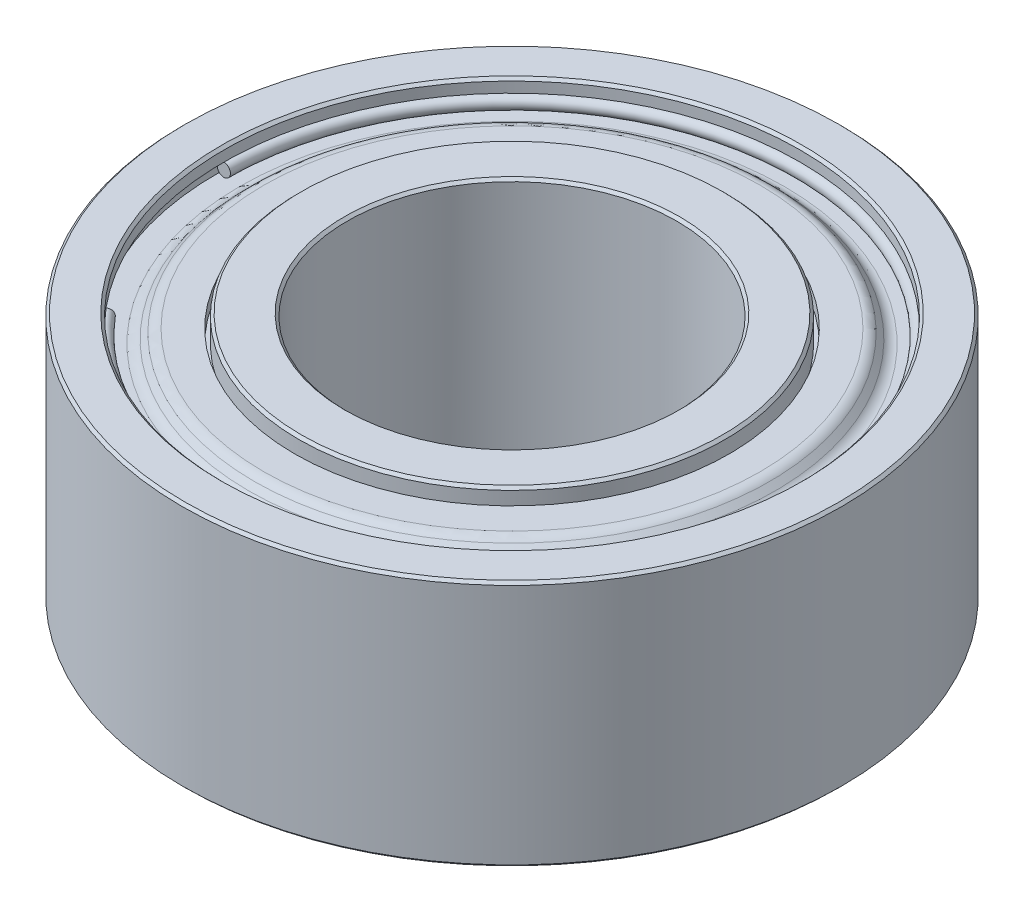
ISO-10303-21;
HEADER;
FILE_DESCRIPTION(('STEP AP214'),'2;1');
FILE_NAME('part.step','',(''),(''),'','','');
FILE_SCHEMA(('AUTOMOTIVE_DESIGN { 1 0 10303 214 1 1 1 1 }'));
ENDSEC;
DATA;
#1=APPLICATION_CONTEXT('core data for automotive mechanical design processes');
#2=APPLICATION_PROTOCOL_DEFINITION('international standard','automotive_design',2000,#1);
#3=PRODUCT_CONTEXT('',#1,'mechanical');
#4=PRODUCT('Part','Part','',(#3));
#5=PRODUCT_RELATED_PRODUCT_CATEGORY('part','',(#4));
#6=PRODUCT_DEFINITION_FORMATION('','',#4);
#7=PRODUCT_DEFINITION_CONTEXT('part definition',#1,'design');
#8=PRODUCT_DEFINITION('design','',#6,#7);
#9=PRODUCT_DEFINITION_SHAPE('','',#8);
#10=(LENGTH_UNIT() NAMED_UNIT(*) SI_UNIT(.MILLI.,.METRE.));
#11=(NAMED_UNIT(*) PLANE_ANGLE_UNIT() SI_UNIT($,.RADIAN.));
#12=(NAMED_UNIT(*) SI_UNIT($,.STERADIAN.) SOLID_ANGLE_UNIT());
#13=UNCERTAINTY_MEASURE_WITH_UNIT(LENGTH_MEASURE(1.E-05),#10,'distance_accuracy_value','');
#14=(GEOMETRIC_REPRESENTATION_CONTEXT(3) GLOBAL_UNCERTAINTY_ASSIGNED_CONTEXT((#13)) GLOBAL_UNIT_ASSIGNED_CONTEXT((#10,
#11,#12)) REPRESENTATION_CONTEXT('',''));
#15=CARTESIAN_POINT('',(0.,0.,0.));
#16=DIRECTION('',(0.,0.,1.));
#17=DIRECTION('',(1.,0.,0.));
#18=AXIS2_PLACEMENT_3D('',#15,#16,#17);
#19=CARTESIAN_POINT('',(0.,0.,0.));
#20=DIRECTION('',(0.64278760968653,0.,0.766044443118986));
#21=DIRECTION('',(0.766044443118986,0.,-0.64278760968653));
#22=AXIS2_PLACEMENT_3D('',#19,#20,#21);
#23=PLANE('',#22);
#24=CARTESIAN_POINT('',(-4.15418241058994,2.00025,3.48577292856909));
#25=CARTESIAN_POINT('',(-4.15418930493398,2.01448035707391,3.48577871361062));
#26=CARTESIAN_POINT('',(-4.15604733989819,2.02879828029162,3.48733779006381));
#27=CARTESIAN_POINT('',(-4.16328592517261,2.05577713981076,3.49341168429782));
#28=CARTESIAN_POINT('',(-4.16866647548281,2.06843807611218,3.49792650207864));
#29=CARTESIAN_POINT('',(-4.18233551241622,2.0907338982527,3.50939618592801));
#30=CARTESIAN_POINT('',(-4.1906239990395,2.10036878409172,3.51635105199662));
#31=CARTESIAN_POINT('',(-4.20917658235864,2.11551068307499,3.5319185178171));
#32=CARTESIAN_POINT('',(-4.2194406790545,2.12101769621925,3.54053111756897));
#33=CARTESIAN_POINT('',(-4.24078669527091,2.12728686264336,3.55844255190326));
#34=CARTESIAN_POINT('',(-4.25186861479146,2.12804901592321,3.56774138648568));
#35=CARTESIAN_POINT('',(-4.2736010893698,2.12474255040931,3.58597709788894));
#36=CARTESIAN_POINT('',(-4.2842516444276,2.12067393161555,3.59491397470978));
#37=CARTESIAN_POINT('',(-4.3039203487017,2.10816068190603,3.6114179772119));
#38=CARTESIAN_POINT('',(-4.31293849791799,2.09971605099026,3.61898510289319));
#39=CARTESIAN_POINT('',(-4.32832653587489,2.07941861413728,3.63189719986737));
#40=CARTESIAN_POINT('',(-4.33469642461549,2.06756580820007,3.63724217116025));
#41=CARTESIAN_POINT('',(-4.34406656395272,2.0417292051199,3.64510465162219));
#42=CARTESIAN_POINT('',(-4.34706681454934,2.02774540797693,3.64762216079126));
#43=CARTESIAN_POINT('',(-4.34858022980807,2.00916030553464,3.64889206697668));
#44=CARTESIAN_POINT('',(-4.34875985966417,2.00470945246293,3.64904279432268));
#45=CARTESIAN_POINT('',(-4.34875080479814,1.98601964292609,3.64903519638793));
#46=CARTESIAN_POINT('',(-4.34689276983392,1.97170171970838,3.64747611993475));
#47=CARTESIAN_POINT('',(-4.3396541845595,1.94472286018924,3.64140222570074));
#48=CARTESIAN_POINT('',(-4.3342736342493,1.93206192388782,3.63688740791991));
#49=CARTESIAN_POINT('',(-4.32060459731589,1.9097661017473,3.62541772407054));
#50=CARTESIAN_POINT('',(-4.31231611069261,1.90013121590828,3.61846285800193));
#51=CARTESIAN_POINT('',(-4.29376352737347,1.884989316925,3.60289539218146));
#52=CARTESIAN_POINT('',(-4.28349943067761,1.87948230378075,3.59428279242959));
#53=CARTESIAN_POINT('',(-4.2621534144612,1.87321313735664,3.5763713580953));
#54=CARTESIAN_POINT('',(-4.25107149494066,1.87245098407679,3.56707252351287));
#55=CARTESIAN_POINT('',(-4.22933902036231,1.87575744959069,3.54883681210961));
#56=CARTESIAN_POINT('',(-4.21868846530451,1.87982606838444,3.53989993528878));
#57=CARTESIAN_POINT('',(-4.19901976103042,1.89233931809397,3.52339593278665));
#58=CARTESIAN_POINT('',(-4.19000161181412,1.90078394900974,3.51582880710536));
#59=CARTESIAN_POINT('',(-4.17461357385723,1.92108138586272,3.50291671013119));
#60=CARTESIAN_POINT('',(-4.16824368511663,1.93293419179993,3.49757173883831));
#61=CARTESIAN_POINT('',(-4.1588735457794,1.9587707948801,3.48970925837636));
#62=CARTESIAN_POINT('',(-4.15587329518277,1.97275459202306,3.48719174920729));
#63=CARTESIAN_POINT('',(-4.15435987992404,1.99133969446536,3.48592184302187));
#64=CARTESIAN_POINT('',(-4.15418025006795,1.99579054753707,3.48577111567587));
#65=CARTESIAN_POINT('',(-4.15418241058994,2.00025,3.48577292856909));
#66=B_SPLINE_CURVE_WITH_KNOTS('',3,(#24,#25,#26,#27,#28,#29,#30,#31,#32,#33,#34,#35,#36,#37,#38,
#39,#40,#41,#42,#43,#44,#45,#46,#47,#48,#49,#50,#51,#52,#53,#54,#55,#56,#57,#58,#59,#60,#61,#62,
#63,#64,#65),.UNSPECIFIED.,.T.,.F.,(4,2,2,2,2,2,2,2,2,2,2,2,2,2,2,2,2,2,2,2,4),(0.,
0.0426429642402334,0.0852859284804667,0.127928892721777,0.170571856963085,0.213214821204394,
0.255857785445703,0.298500749687013,0.341143713928323,0.383786678169631,0.397149959984691,
0.439792924224925,0.482435888465158,0.525078852706467,0.567721816947776,0.610364781189085,
0.653007745430396,0.695650709671704,0.738293673913014,0.780936638154323,0.794299919969383),.UNSPECIFIED.);
#67=CARTESIAN_POINT('',(-4.15418241058994,2.00025,3.48577292856909));
#68=VERTEX_POINT('',#67);
#69=EDGE_CURVE('P0_E19',#68,#68,#66,.T.);
#70=ORIENTED_EDGE('',*,*,#69,.F.);
#71=EDGE_LOOP('',(#70));
#72=FACE_BOUND('',#71,.T.);
#73=ADVANCED_FACE('P0_F15',(#72),#23,.F.);
#74=CARTESIAN_POINT('',(0.,0.,0.));
#75=DIRECTION('',(0.,0.,1.));
#76=DIRECTION('',(1.,0.,0.));
#77=AXIS2_PLACEMENT_3D('',#74,#75,#76);
#78=PLANE('',#77);
#79=CARTESIAN_POINT('',(-5.6769,2.00025,0.));
#80=CARTESIAN_POINT('',(-5.67689100007304,2.01448035707391,0.));
#81=CARTESIAN_POINT('',(-5.67446550768693,2.02879828029162,0.));
#82=CARTESIAN_POINT('',(-5.66501620570525,2.05577713981076,0.));
#83=CARTESIAN_POINT('',(-5.65799239610969,2.06843807611218,0.));
#84=CARTESIAN_POINT('',(-5.64014873565866,2.0907338982527,0.));
#85=CARTESIAN_POINT('',(-5.62932888480311,2.10036878409172,0.));
#86=CARTESIAN_POINT('',(-5.60511020730236,2.11551068307499,0.));
#87=CARTESIAN_POINT('',(-5.59171138065716,2.12101769621925,0.));
#88=CARTESIAN_POINT('',(-5.56384613549006,2.12728686264336,0.));
#89=CARTESIAN_POINT('',(-5.54937971696815,2.12804901592321,0.));
#90=CARTESIAN_POINT('',(-5.52100998623835,2.12474255040931,0.));
#91=CARTESIAN_POINT('',(-5.50710667403046,2.12067393161555,0.));
#92=CARTESIAN_POINT('',(-5.48143100409933,2.10816068190603,0.));
#93=CARTESIAN_POINT('',(-5.4696586463761,2.09971605099026,0.));
#94=CARTESIAN_POINT('',(-5.44957098945865,2.07941861413728,0.));
#95=CARTESIAN_POINT('',(-5.44125569026443,2.06756580820007,0.));
#96=CARTESIAN_POINT('',(-5.42902384207155,2.0417292051199,0.));
#97=CARTESIAN_POINT('',(-5.4251072930729,2.02774540797694,0.));
#98=CARTESIAN_POINT('',(-5.42313166976236,2.00916030553464,0.));
#99=CARTESIAN_POINT('',(-5.42289717963883,2.00470945246293,0.));
#100=CARTESIAN_POINT('',(-5.42290899992696,1.98601964292609,0.));
#101=CARTESIAN_POINT('',(-5.42533449231307,1.97170171970838,0.));
#102=CARTESIAN_POINT('',(-5.43478379429475,1.94472286018924,0.));
#103=CARTESIAN_POINT('',(-5.44180760389031,1.93206192388782,0.));
#104=CARTESIAN_POINT('',(-5.45965126434134,1.9097661017473,0.));
#105=CARTESIAN_POINT('',(-5.47047111519689,1.90013121590828,0.));
#106=CARTESIAN_POINT('',(-5.49468979269764,1.884989316925,0.));
#107=CARTESIAN_POINT('',(-5.50808861934284,1.87948230378075,0.));
#108=CARTESIAN_POINT('',(-5.53595386450994,1.87321313735664,0.));
#109=CARTESIAN_POINT('',(-5.55042028303185,1.87245098407679,0.));
#110=CARTESIAN_POINT('',(-5.57879001376165,1.87575744959069,0.));
#111=CARTESIAN_POINT('',(-5.59269332596954,1.87982606838444,0.));
#112=CARTESIAN_POINT('',(-5.61836899590066,1.89233931809397,0.));
#113=CARTESIAN_POINT('',(-5.6301413536239,1.90078394900974,0.));
#114=CARTESIAN_POINT('',(-5.65022901054135,1.92108138586272,0.));
#115=CARTESIAN_POINT('',(-5.65854430973557,1.93293419179993,0.));
#116=CARTESIAN_POINT('',(-5.67077615792845,1.9587707948801,0.));
#117=CARTESIAN_POINT('',(-5.6746927069271,1.97275459202306,0.));
#118=CARTESIAN_POINT('',(-5.67666833023764,1.99133969446536,0.));
#119=CARTESIAN_POINT('',(-5.67690282036117,1.99579054753707,0.));
#120=CARTESIAN_POINT('',(-5.6769,2.00025,0.));
#121=B_SPLINE_CURVE_WITH_KNOTS('',3,(#79,#80,#81,#82,#83,#84,#85,#86,#87,#88,#89,#90,#91,#92,
#93,#94,#95,#96,#97,#98,#99,#100,#101,#102,#103,#104,#105,#106,#107,#108,#109,#110,#111,#112,
#113,#114,#115,#116,#117,#118,#119,#120),.UNSPECIFIED.,.T.,.F.,(4,2,2,2,2,2,2,2,2,2,2,2,2,2,2,2,
2,2,2,2,4),(0.,0.0426429642402329,0.0852859284804661,0.127928892721774,0.170571856963085,
0.213214821204393,0.255857785445703,0.298500749687013,0.341143713928322,0.383786678169631,
0.397149959984692,0.439792924224925,0.482435888465158,0.525078852706467,0.567721816947776,
0.610364781189086,0.653007745430395,0.695650709671704,0.738293673913013,0.780936638154323,
0.794299919969383),.UNSPECIFIED.);
#122=CARTESIAN_POINT('',(-5.6769,2.00025,0.));
#123=VERTEX_POINT('',#122);
#124=EDGE_CURVE('P0_E10',#123,#123,#121,.T.);
#125=ORIENTED_EDGE('',*,*,#124,.F.);
#126=EDGE_LOOP('',(#125));
#127=FACE_BOUND('',#126,.T.);
#128=ADVANCED_FACE('P0_F35',(#127),#78,.T.);
#129=CARTESIAN_POINT('',(0.,2.00025,0.));
#130=DIRECTION('',(0.,1.,0.));
#131=DIRECTION('',(0.,0.,1.));
#132=AXIS2_PLACEMENT_3D('',#129,#130,#131);
#133=TOROIDAL_SURFACE('',#132,5.5499,0.127000000000001);
#134=ORIENTED_EDGE('',*,*,#124,.T.);
#135=EDGE_LOOP('',(#134));
#136=FACE_BOUND('',#135,.T.);
#137=ORIENTED_EDGE('',*,*,#69,.T.);
#138=EDGE_LOOP('',(#137));
#139=FACE_BOUND('',#138,.T.);
#140=ADVANCED_FACE('P0_F33',(#136,#139),#133,.T.);
#141=CLOSED_SHELL('',(#73,#128,#140));
#142=MANIFOLD_SOLID_BREP('P0_B1',#141);
#143=CARTESIAN_POINT('',(0.,2.38125,0.));
#144=DIRECTION('',(0.,-1.,0.));
#145=DIRECTION('',(0.,0.,-1.));
#146=AXIS2_PLACEMENT_3D('',#143,#144,#145);
#147=CYLINDRICAL_SURFACE('',#146,3.175);
#148=CARTESIAN_POINT('',(0.,-2.33045000004495,0.));
#149=DIRECTION('',(0.,-1.,0.));
#150=DIRECTION('',(0.,0.,-1.));
#151=AXIS2_PLACEMENT_3D('',#148,#149,#150);
#152=CIRCLE('',#151,3.17499999999882);
#153=CARTESIAN_POINT('',(0.,-2.33045000004495,-3.17499999999882));
#154=VERTEX_POINT('',#153);
#155=EDGE_CURVE('P1_E410',#154,#154,#152,.T.);
#156=ORIENTED_EDGE('',*,*,#155,.T.);
#157=EDGE_LOOP('',(#156));
#158=FACE_BOUND('',#157,.T.);
#159=CARTESIAN_POINT('',(0.,2.3304499999881,0.));
#160=DIRECTION('',(0.,1.,0.));
#161=DIRECTION('',(0.,0.,1.));
#162=AXIS2_PLACEMENT_3D('',#159,#160,#161);
#163=CIRCLE('',#162,3.17500000005566);
#164=CARTESIAN_POINT('',(0.,2.3304499999881,3.17500000005566));
#165=VERTEX_POINT('',#164);
#166=EDGE_CURVE('P1_E413',#165,#165,#163,.T.);
#167=ORIENTED_EDGE('',*,*,#166,.T.);
#168=EDGE_LOOP('',(#167));
#169=FACE_BOUND('',#168,.T.);
#170=ADVANCED_FACE('P1_F17',(#158,#169),#147,.F.);
#171=CARTESIAN_POINT('',(0.,2.38124999992806,0.));
#172=DIRECTION('',(0.,1.,0.));
#173=DIRECTION('',(0.,0.,1.));
#174=AXIS2_PLACEMENT_3D('',#171,#172,#173);
#175=CONICAL_SURFACE('',#174,3.22579999999562,0.785398163397448);
#176=ORIENTED_EDGE('',*,*,#166,.F.);
#177=EDGE_LOOP('',(#176));
#178=FACE_BOUND('',#177,.T.);
#179=CARTESIAN_POINT('',(0.,2.38124999992806,0.));
#180=DIRECTION('',(0.,1.,0.));
#181=DIRECTION('',(0.,0.,1.));
#182=AXIS2_PLACEMENT_3D('',#179,#180,#181);
#183=CIRCLE('',#182,3.22579999999562);
#184=CARTESIAN_POINT('',(0.,2.38124999992806,3.22579999999562));
#185=VERTEX_POINT('',#184);
#186=EDGE_CURVE('P1_E408',#185,#185,#183,.F.);
#187=ORIENTED_EDGE('',*,*,#186,.F.);
#188=EDGE_LOOP('',(#187));
#189=FACE_BOUND('',#188,.T.);
#190=ADVANCED_FACE('P1_F186',(#178,#189),#175,.F.);
#191=CARTESIAN_POINT('',(0.,-2.3812499999849,0.));
#192=DIRECTION('',(0.,-1.,0.));
#193=DIRECTION('',(0.,0.,-1.));
#194=AXIS2_PLACEMENT_3D('',#191,#192,#193);
#195=CONICAL_SURFACE('',#194,3.22579999993877,0.785398162837966);
#196=CARTESIAN_POINT('',(0.,-2.3812499999849,0.));
#197=DIRECTION('',(0.,-1.,0.));
#198=DIRECTION('',(0.,0.,-1.));
#199=AXIS2_PLACEMENT_3D('',#196,#197,#198);
#200=CIRCLE('',#199,3.22579999993877);
#201=CARTESIAN_POINT('',(0.,-2.3812499999849,-3.22579999993877));
#202=VERTEX_POINT('',#201);
#203=EDGE_CURVE('P1_E406',#202,#202,#200,.T.);
#204=ORIENTED_EDGE('',*,*,#203,.T.);
#205=EDGE_LOOP('',(#204));
#206=FACE_BOUND('',#205,.T.);
#207=ORIENTED_EDGE('',*,*,#155,.F.);
#208=EDGE_LOOP('',(#207));
#209=FACE_BOUND('',#208,.T.);
#210=ADVANCED_FACE('P1_F183',(#206,#209),#195,.F.);
#211=CARTESIAN_POINT('',(0.,2.38125,0.));
#212=DIRECTION('',(0.,1.,0.));
#213=DIRECTION('',(0.,0.,1.));
#214=AXIS2_PLACEMENT_3D('',#211,#212,#213);
#215=PLANE('',#214);
#216=ORIENTED_EDGE('',*,*,#186,.T.);
#217=EDGE_LOOP('',(#216));
#218=FACE_BOUND('',#217,.T.);
#219=CARTESIAN_POINT('',(0.,2.3812499999849,0.));
#220=DIRECTION('',(0.,-1.,0.));
#221=DIRECTION('',(0.,0.,-1.));
#222=AXIS2_PLACEMENT_3D('',#219,#220,#221);
#223=CIRCLE('',#222,4.05764999999292);
#224=CARTESIAN_POINT('',(0.,2.3812499999849,-4.05764999999292));
#225=VERTEX_POINT('',#224);
#226=EDGE_CURVE('P1_E403',#225,#225,#223,.T.);
#227=ORIENTED_EDGE('',*,*,#226,.F.);
#228=EDGE_LOOP('',(#227));
#229=FACE_BOUND('',#228,.T.);
#230=ADVANCED_FACE('P1_F179',(#218,#229),#215,.T.);
#231=CARTESIAN_POINT('',(0.,-2.38125,0.));
#232=DIRECTION('',(0.,1.,0.));
#233=DIRECTION('',(0.,0.,1.));
#234=AXIS2_PLACEMENT_3D('',#231,#232,#233);
#235=PLANE('',#234);
#236=CARTESIAN_POINT('',(0.,-2.38125000004175,0.));
#237=DIRECTION('',(0.,1.,0.));
#238=DIRECTION('',(0.,0.,1.));
#239=AXIS2_PLACEMENT_3D('',#236,#237,#238);
#240=CIRCLE('',#239,4.05764999993607);
#241=CARTESIAN_POINT('',(0.,-2.38125000004175,4.05764999993607));
#242=VERTEX_POINT('',#241);
#243=EDGE_CURVE('P1_E399',#242,#242,#240,.T.);
#244=ORIENTED_EDGE('',*,*,#243,.F.);
#245=EDGE_LOOP('',(#244));
#246=FACE_BOUND('',#245,.T.);
#247=ORIENTED_EDGE('',*,*,#203,.F.);
#248=EDGE_LOOP('',(#247));
#249=FACE_BOUND('',#248,.T.);
#250=ADVANCED_FACE('P1_F175',(#246,#249),#235,.F.);
#251=CARTESIAN_POINT('',(0.,2.33044999987442,0.));
#252=DIRECTION('',(0.,-1.,0.));
#253=DIRECTION('',(0.,0.,-1.));
#254=AXIS2_PLACEMENT_3D('',#251,#252,#253);
#255=CONICAL_SURFACE('',#254,4.1084500001034,0.785398163397448);
#256=ORIENTED_EDGE('',*,*,#226,.T.);
#257=EDGE_LOOP('',(#256));
#258=FACE_BOUND('',#257,.T.);
#259=CARTESIAN_POINT('',(0.,2.33045,0.));
#260=DIRECTION('',(0.,1.,0.));
#261=DIRECTION('',(0.,0.,1.));
#262=AXIS2_PLACEMENT_3D('',#259,#260,#261);
#263=CIRCLE('',#262,4.10845);
#264=CARTESIAN_POINT('',(0.,2.33045,4.10845));
#265=VERTEX_POINT('',#264);
#266=EDGE_CURVE('P1_E402',#265,#265,#263,.F.);
#267=ORIENTED_EDGE('',*,*,#266,.F.);
#268=EDGE_LOOP('',(#267));
#269=FACE_BOUND('',#268,.T.);
#270=ADVANCED_FACE('P1_F171',(#258,#269),#255,.T.);
#271=CARTESIAN_POINT('',(0.,-2.3304499999881,0.));
#272=DIRECTION('',(0.,1.,0.));
#273=DIRECTION('',(0.,0.,1.));
#274=AXIS2_PLACEMENT_3D('',#271,#272,#273);
#275=CONICAL_SURFACE('',#274,4.10844999998972,0.785398163397448);
#276=CARTESIAN_POINT('',(0.,-2.33045,0.));
#277=DIRECTION('',(0.,-1.,0.));
#278=DIRECTION('',(0.,0.,-1.));
#279=AXIS2_PLACEMENT_3D('',#276,#277,#278);
#280=CIRCLE('',#279,4.10845);
#281=CARTESIAN_POINT('',(0.,-2.33045,-4.10845));
#282=VERTEX_POINT('',#281);
#283=EDGE_CURVE('P1_E79',#282,#282,#280,.F.);
#284=ORIENTED_EDGE('',*,*,#283,.F.);
#285=EDGE_LOOP('',(#284));
#286=FACE_BOUND('',#285,.T.);
#287=ORIENTED_EDGE('',*,*,#243,.T.);
#288=EDGE_LOOP('',(#287));
#289=FACE_BOUND('',#288,.T.);
#290=ADVANCED_FACE('P1_F167',(#286,#289),#275,.T.);
#291=CARTESIAN_POINT('',(0.,2.12725,0.));
#292=DIRECTION('',(0.,1.,0.));
#293=DIRECTION('',(0.,0.,1.));
#294=AXIS2_PLACEMENT_3D('',#291,#292,#293);
#295=CYLINDRICAL_SURFACE('',#294,4.10845);
#296=CARTESIAN_POINT('',(0.,1.87325,0.));
#297=DIRECTION('',(0.,1.,0.));
#298=DIRECTION('',(0.,0.,1.));
#299=AXIS2_PLACEMENT_3D('',#296,#297,#298);
#300=CIRCLE('',#299,4.10845);
#301=CARTESIAN_POINT('',(0.,1.87325,4.10845));
#302=VERTEX_POINT('',#301);
#303=EDGE_CURVE('P1_E396',#302,#302,#300,.F.);
#304=ORIENTED_EDGE('',*,*,#303,.F.);
#305=EDGE_LOOP('',(#304));
#306=FACE_BOUND('',#305,.T.);
#307=ORIENTED_EDGE('',*,*,#266,.T.);
#308=EDGE_LOOP('',(#307));
#309=FACE_BOUND('',#308,.T.);
#310=ADVANCED_FACE('P1_F163',(#306,#309),#295,.T.);
#311=CARTESIAN_POINT('',(0.,-2.12725,0.));
#312=DIRECTION('',(0.,-1.,0.));
#313=DIRECTION('',(0.,0.,-1.));
#314=AXIS2_PLACEMENT_3D('',#311,#312,#313);
#315=CYLINDRICAL_SURFACE('',#314,4.10845);
#316=ORIENTED_EDGE('',*,*,#283,.T.);
#317=EDGE_LOOP('',(#316));
#318=FACE_BOUND('',#317,.T.);
#319=CARTESIAN_POINT('',(0.,-1.87325,0.));
#320=DIRECTION('',(0.,-1.,0.));
#321=DIRECTION('',(0.,0.,-1.));
#322=AXIS2_PLACEMENT_3D('',#319,#320,#321);
#323=CIRCLE('',#322,4.10845);
#324=CARTESIAN_POINT('',(0.,-1.87325,-4.10845));
#325=VERTEX_POINT('',#324);
#326=EDGE_CURVE('P1_E393',#325,#325,#323,.F.);
#327=ORIENTED_EDGE('',*,*,#326,.F.);
#328=EDGE_LOOP('',(#327));
#329=FACE_BOUND('',#328,.T.);
#330=ADVANCED_FACE('P1_F159',(#318,#329),#315,.T.);
#331=CARTESIAN_POINT('',(0.,1.87325,0.));
#332=DIRECTION('',(0.,1.,0.));
#333=DIRECTION('',(0.,0.,1.));
#334=AXIS2_PLACEMENT_3D('',#331,#332,#333);
#335=PLANE('',#334);
#336=CARTESIAN_POINT('',(0.,1.87325,0.));
#337=DIRECTION('',(0.,1.,0.));
#338=DIRECTION('',(0.,0.,1.));
#339=AXIS2_PLACEMENT_3D('',#336,#337,#338);
#340=CIRCLE('',#339,4.1855922886146);
#341=CARTESIAN_POINT('',(0.,1.87325,4.1855922886146));
#342=VERTEX_POINT('',#341);
#343=EDGE_CURVE('P1_E390',#342,#342,#340,.T.);
#344=ORIENTED_EDGE('',*,*,#343,.T.);
#345=EDGE_LOOP('',(#344));
#346=FACE_BOUND('',#345,.T.);
#347=ORIENTED_EDGE('',*,*,#303,.T.);
#348=EDGE_LOOP('',(#347));
#349=FACE_BOUND('',#348,.T.);
#350=ADVANCED_FACE('P1_F155',(#346,#349),#335,.T.);
#351=CARTESIAN_POINT('',(0.,-1.87325,0.));
#352=DIRECTION('',(0.,-1.,0.));
#353=DIRECTION('',(0.,0.,-1.));
#354=AXIS2_PLACEMENT_3D('',#351,#352,#353);
#355=PLANE('',#354);
#356=ORIENTED_EDGE('',*,*,#326,.T.);
#357=EDGE_LOOP('',(#356));
#358=FACE_BOUND('',#357,.T.);
#359=CARTESIAN_POINT('',(0.,-1.87325,0.));
#360=DIRECTION('',(0.,-1.,0.));
#361=DIRECTION('',(0.,0.,-1.));
#362=AXIS2_PLACEMENT_3D('',#359,#360,#361);
#363=CIRCLE('',#362,4.1855922886146);
#364=CARTESIAN_POINT('',(0.,-1.87325,-4.1855922886146));
#365=VERTEX_POINT('',#364);
#366=EDGE_CURVE('P1_E387',#365,#365,#363,.T.);
#367=ORIENTED_EDGE('',*,*,#366,.T.);
#368=EDGE_LOOP('',(#367));
#369=FACE_BOUND('',#368,.T.);
#370=ADVANCED_FACE('P1_F151',(#358,#369),#355,.T.);
#371=CARTESIAN_POINT('',(0.,1.87325,0.));
#372=DIRECTION('',(0.,1.,0.));
#373=DIRECTION('',(0.,0.,1.));
#374=AXIS2_PLACEMENT_3D('',#371,#372,#373);
#375=CYLINDRICAL_SURFACE('',#374,4.1855922886146);
#376=CARTESIAN_POINT('',(0.,2.12725,0.));
#377=DIRECTION('',(0.,1.,0.));
#378=DIRECTION('',(0.,0.,1.));
#379=AXIS2_PLACEMENT_3D('',#376,#377,#378);
#380=CIRCLE('',#379,4.1855922886146);
#381=CARTESIAN_POINT('',(0.,2.12725,4.1855922886146));
#382=VERTEX_POINT('',#381);
#383=EDGE_CURVE('P1_E384',#382,#382,#380,.F.);
#384=ORIENTED_EDGE('',*,*,#383,.F.);
#385=EDGE_LOOP('',(#384));
#386=FACE_BOUND('',#385,.T.);
#387=ORIENTED_EDGE('',*,*,#343,.F.);
#388=EDGE_LOOP('',(#387));
#389=FACE_BOUND('',#388,.T.);
#390=ADVANCED_FACE('P1_F147',(#386,#389),#375,.F.);
#391=CARTESIAN_POINT('',(0.,-1.87325,0.));
#392=DIRECTION('',(0.,-1.,0.));
#393=DIRECTION('',(0.,0.,-1.));
#394=AXIS2_PLACEMENT_3D('',#391,#392,#393);
#395=CYLINDRICAL_SURFACE('',#394,4.1855922886146);
#396=ORIENTED_EDGE('',*,*,#366,.F.);
#397=EDGE_LOOP('',(#396));
#398=FACE_BOUND('',#397,.T.);
#399=CARTESIAN_POINT('',(0.,-2.12725,0.));
#400=DIRECTION('',(0.,-1.,0.));
#401=DIRECTION('',(0.,0.,-1.));
#402=AXIS2_PLACEMENT_3D('',#399,#400,#401);
#403=CIRCLE('',#402,4.1855922886146);
#404=CARTESIAN_POINT('',(0.,-2.12725,-4.1855922886146));
#405=VERTEX_POINT('',#404);
#406=EDGE_CURVE('P1_E65',#405,#405,#403,.F.);
#407=ORIENTED_EDGE('',*,*,#406,.F.);
#408=EDGE_LOOP('',(#407));
#409=FACE_BOUND('',#408,.T.);
#410=ADVANCED_FACE('P1_F143',(#398,#409),#395,.F.);
#411=CARTESIAN_POINT('',(0.,2.12725,0.));
#412=DIRECTION('',(0.,1.,0.));
#413=DIRECTION('',(0.,0.,1.));
#414=AXIS2_PLACEMENT_3D('',#411,#412,#413);
#415=PLANE('',#414);
#416=CARTESIAN_POINT('',(0.,2.12725,0.));
#417=DIRECTION('',(0.,-1.,0.));
#418=DIRECTION('',(0.,0.,-1.));
#419=AXIS2_PLACEMENT_3D('',#416,#417,#418);
#420=CIRCLE('',#419,4.7801495690683);
#421=CARTESIAN_POINT('',(0.,2.12725,-4.7801495690683));
#422=VERTEX_POINT('',#421);
#423=CARTESIAN_POINT('',(0.,2.12725,4.7801495690683));
#424=VERTEX_POINT('',#423);
#425=EDGE_CURVE('P1_E63',#422,#424,#420,.T.);
#426=ORIENTED_EDGE('',*,*,#425,.F.);
#427=CARTESIAN_POINT('',(0.,2.12725,0.));
#428=DIRECTION('',(0.,-1.,0.));
#429=DIRECTION('',(0.,0.,1.));
#430=AXIS2_PLACEMENT_3D('',#427,#428,#429);
#431=CIRCLE('',#430,4.7801495690683);
#432=EDGE_CURVE('P1_E57',#424,#422,#431,.T.);
#433=ORIENTED_EDGE('',*,*,#432,.F.);
#434=EDGE_LOOP('',(#426,#433));
#435=FACE_BOUND('',#434,.T.);
#436=ORIENTED_EDGE('',*,*,#383,.T.);
#437=EDGE_LOOP('',(#436));
#438=FACE_BOUND('',#437,.T.);
#439=ADVANCED_FACE('P1_F61',(#435,#438),#415,.T.);
#440=CARTESIAN_POINT('',(0.,-2.12725,0.));
#441=DIRECTION('',(0.,-1.,0.));
#442=DIRECTION('',(0.,0.,-1.));
#443=AXIS2_PLACEMENT_3D('',#440,#441,#442);
#444=PLANE('',#443);
#445=ORIENTED_EDGE('',*,*,#406,.T.);
#446=EDGE_LOOP('',(#445));
#447=FACE_BOUND('',#446,.T.);
#448=CARTESIAN_POINT('',(0.,-2.12725,0.));
#449=DIRECTION('',(0.,1.,0.));
#450=DIRECTION('',(0.,0.,1.));
#451=AXIS2_PLACEMENT_3D('',#448,#449,#450);
#452=CIRCLE('',#451,4.7801495690683);
#453=CARTESIAN_POINT('',(0.,-2.12725,4.7801495690683));
#454=VERTEX_POINT('',#453);
#455=CARTESIAN_POINT('',(0.,-2.12725,-4.7801495690683));
#456=VERTEX_POINT('',#455);
#457=EDGE_CURVE('P1_E106',#454,#456,#452,.T.);
#458=ORIENTED_EDGE('',*,*,#457,.F.);
#459=CARTESIAN_POINT('',(0.,-2.12725,0.));
#460=DIRECTION('',(0.,1.,0.));
#461=DIRECTION('',(0.,0.,-1.));
#462=AXIS2_PLACEMENT_3D('',#459,#460,#461);
#463=CIRCLE('',#462,4.7801495690683);
#464=EDGE_CURVE('P1_E71',#456,#454,#463,.T.);
#465=ORIENTED_EDGE('',*,*,#464,.F.);
#466=EDGE_LOOP('',(#458,#465));
#467=FACE_BOUND('',#466,.T.);
#468=ADVANCED_FACE('P1_F92',(#447,#467),#444,.T.);
#469=CARTESIAN_POINT('',(0.,1.87325,0.));
#470=DIRECTION('',(0.,1.,0.));
#471=DIRECTION('',(0.,0.,1.));
#472=AXIS2_PLACEMENT_3D('',#469,#470,#471);
#473=TOROIDAL_SURFACE('',#472,4.7801495690683,0.254);
#474=ORIENTED_EDGE('',*,*,#432,.T.);
#475=ORIENTED_EDGE('',*,*,#425,.T.);
#476=EDGE_LOOP('',(#474,#475));
#477=FACE_BOUND('',#476,.T.);
#478=CARTESIAN_POINT('',(0.,2.05285512237197,0.));
#479=DIRECTION('',(0.,-1.,0.));
#480=DIRECTION('',(0.,0.,-1.));
#481=AXIS2_PLACEMENT_3D('',#478,#479,#480);
#482=CIRCLE('',#481,4.9597546914697);
#483=CARTESIAN_POINT('',(0.,2.05285512237197,-4.9597546914697));
#484=VERTEX_POINT('',#483);
#485=EDGE_CURVE('P1_E101',#484,#484,#482,.T.);
#486=ORIENTED_EDGE('',*,*,#485,.F.);
#487=EDGE_LOOP('',(#486));
#488=FACE_BOUND('',#487,.T.);
#489=ADVANCED_FACE('P1_F69',(#477,#488),#473,.T.);
#490=CARTESIAN_POINT('',(0.,-1.87325,0.));
#491=DIRECTION('',(0.,-1.,0.));
#492=DIRECTION('',(0.,0.,-1.));
#493=AXIS2_PLACEMENT_3D('',#490,#491,#492);
#494=TOROIDAL_SURFACE('',#493,4.7801495690683,0.254);
#495=ORIENTED_EDGE('',*,*,#464,.T.);
#496=ORIENTED_EDGE('',*,*,#457,.T.);
#497=EDGE_LOOP('',(#495,#496));
#498=FACE_BOUND('',#497,.T.);
#499=CARTESIAN_POINT('',(0.,-2.05285512242881,0.));
#500=DIRECTION('',(0.,1.,0.));
#501=DIRECTION('',(0.,0.,1.));
#502=AXIS2_PLACEMENT_3D('',#499,#500,#501);
#503=CIRCLE('',#502,4.95975469152654);
#504=CARTESIAN_POINT('',(0.,-2.05285512242881,4.95975469152654));
#505=VERTEX_POINT('',#504);
#506=EDGE_CURVE('P1_E345',#505,#505,#503,.T.);
#507=ORIENTED_EDGE('',*,*,#506,.F.);
#508=EDGE_LOOP('',(#507));
#509=FACE_BOUND('',#508,.T.);
#510=ADVANCED_FACE('P1_F91',(#498,#509),#494,.T.);
#511=CARTESIAN_POINT('',(0.,1.94764487764587,0.));
#512=DIRECTION('',(0.,-1.,0.));
#513=DIRECTION('',(1.,0.,0.));
#514=AXIS2_PLACEMENT_3D('',#511,#512,#513);
#515=CONICAL_SURFACE('',#514,5.06496493625264,0.785398163397448);
#516=CARTESIAN_POINT('',(0.,1.94764487757862,0.));
#517=DIRECTION('',(0.,1.,0.));
#518=DIRECTION('',(0.,0.,1.));
#519=AXIS2_PLACEMENT_3D('',#516,#517,#518);
#520=CIRCLE('',#519,5.06496493633244);
#521=CARTESIAN_POINT('',(0.,1.94764487757862,5.06496493633244));
#522=VERTEX_POINT('',#521);
#523=EDGE_CURVE('P1_E349',#522,#522,#520,.T.);
#524=ORIENTED_EDGE('',*,*,#523,.T.);
#525=EDGE_LOOP('',(#524));
#526=FACE_BOUND('',#525,.T.);
#527=ORIENTED_EDGE('',*,*,#485,.T.);
#528=EDGE_LOOP('',(#527));
#529=FACE_BOUND('',#528,.T.);
#530=ADVANCED_FACE('P1_F505',(#526,#529),#515,.T.);
#531=CARTESIAN_POINT('',(0.,-1.94764487764587,0.));
#532=DIRECTION('',(0.,1.,0.));
#533=DIRECTION('',(-1.,0.,0.));
#534=AXIS2_PLACEMENT_3D('',#531,#532,#533);
#535=CONICAL_SURFACE('',#534,5.06496493630948,0.785398163397448);
#536=CARTESIAN_POINT('',(0.,-1.94764487757862,0.));
#537=DIRECTION('',(0.,-1.,0.));
#538=DIRECTION('',(0.,0.,-1.));
#539=AXIS2_PLACEMENT_3D('',#536,#537,#538);
#540=CIRCLE('',#539,5.06496493633245);
#541=CARTESIAN_POINT('',(0.,-1.94764487757862,-5.06496493633245));
#542=VERTEX_POINT('',#541);
#543=EDGE_CURVE('P1_E354',#542,#542,#540,.T.);
#544=ORIENTED_EDGE('',*,*,#543,.T.);
#545=EDGE_LOOP('',(#544));
#546=FACE_BOUND('',#545,.T.);
#547=ORIENTED_EDGE('',*,*,#506,.T.);
#548=EDGE_LOOP('',(#547));
#549=FACE_BOUND('',#548,.T.);
#550=ADVANCED_FACE('P1_F511',(#546,#549),#535,.T.);
#551=CARTESIAN_POINT('',(0.,2.12725,0.));
#552=DIRECTION('',(0.,1.,0.));
#553=DIRECTION('',(0.,0.,1.));
#554=AXIS2_PLACEMENT_3D('',#551,#552,#553);
#555=TOROIDAL_SURFACE('',#554,5.24457005875383,0.254);
#556=ORIENTED_EDGE('',*,*,#523,.F.);
#557=EDGE_LOOP('',(#556));
#558=FACE_BOUND('',#557,.T.);
#559=CARTESIAN_POINT('',(0.,1.87325,0.));
#560=DIRECTION('',(0.,1.,0.));
#561=DIRECTION('',(0.,0.,-1.));
#562=AXIS2_PLACEMENT_3D('',#559,#560,#561);
#563=CIRCLE('',#562,5.24457005875383);
#564=CARTESIAN_POINT('',(0.,1.87325,5.24457005875383));
#565=VERTEX_POINT('',#564);
#566=CARTESIAN_POINT('',(0.,1.87325,-5.24457005875383));
#567=VERTEX_POINT('',#566);
#568=EDGE_CURVE('P1_E281',#565,#567,#563,.F.);
#569=ORIENTED_EDGE('',*,*,#568,.F.);
#570=CARTESIAN_POINT('',(0.,1.87325,0.));
#571=DIRECTION('',(0.,1.,0.));
#572=DIRECTION('',(0.,0.,1.));
#573=AXIS2_PLACEMENT_3D('',#570,#571,#572);
#574=CIRCLE('',#573,5.24457005875383);
#575=EDGE_CURVE('P1_E291',#567,#565,#574,.F.);
#576=ORIENTED_EDGE('',*,*,#575,.F.);
#577=EDGE_LOOP('',(#569,#576));
#578=FACE_BOUND('',#577,.T.);
#579=ADVANCED_FACE('P1_F306',(#558,#578),#555,.F.);
#580=CARTESIAN_POINT('',(0.,-2.12725,0.));
#581=DIRECTION('',(0.,-1.,0.));
#582=DIRECTION('',(0.,0.,-1.));
#583=AXIS2_PLACEMENT_3D('',#580,#581,#582);
#584=TOROIDAL_SURFACE('',#583,5.24457005875383,0.254);
#585=ORIENTED_EDGE('',*,*,#543,.F.);
#586=EDGE_LOOP('',(#585));
#587=FACE_BOUND('',#586,.T.);
#588=CARTESIAN_POINT('',(0.,-1.87325,0.));
#589=DIRECTION('',(0.,-1.,0.));
#590=DIRECTION('',(0.,0.,1.));
#591=AXIS2_PLACEMENT_3D('',#588,#589,#590);
#592=CIRCLE('',#591,5.24457005875383);
#593=CARTESIAN_POINT('',(0.,-1.87325,-5.24457005875383));
#594=VERTEX_POINT('',#593);
#595=CARTESIAN_POINT('',(0.,-1.87325,5.24457005875383));
#596=VERTEX_POINT('',#595);
#597=EDGE_CURVE('P1_E369',#594,#596,#592,.F.);
#598=ORIENTED_EDGE('',*,*,#597,.F.);
#599=CARTESIAN_POINT('',(0.,-1.87325,0.));
#600=DIRECTION('',(0.,-1.,0.));
#601=DIRECTION('',(0.,0.,-1.));
#602=AXIS2_PLACEMENT_3D('',#599,#600,#601);
#603=CIRCLE('',#602,5.24457005875383);
#604=EDGE_CURVE('P1_E36',#596,#594,#603,.F.);
#605=ORIENTED_EDGE('',*,*,#604,.F.);
#606=EDGE_LOOP('',(#598,#605));
#607=FACE_BOUND('',#606,.T.);
#608=ADVANCED_FACE('P1_F302',(#587,#607),#584,.F.);
#609=CARTESIAN_POINT('',(0.,1.87325,0.));
#610=DIRECTION('',(0.,1.,0.));
#611=DIRECTION('',(0.,0.,1.));
#612=AXIS2_PLACEMENT_3D('',#609,#610,#611);
#613=PLANE('',#612);
#614=ORIENTED_EDGE('',*,*,#568,.T.);
#615=ORIENTED_EDGE('',*,*,#575,.T.);
#616=EDGE_LOOP('',(#614,#615));
#617=FACE_BOUND('',#616,.T.);
#618=CARTESIAN_POINT('',(0.,1.87325,0.));
#619=DIRECTION('',(0.,1.,0.));
#620=DIRECTION('',(0.,0.,1.));
#621=AXIS2_PLACEMENT_3D('',#618,#619,#620);
#622=CIRCLE('',#621,5.6769);
#623=CARTESIAN_POINT('',(0.,1.87325,5.6769));
#624=VERTEX_POINT('',#623);
#625=EDGE_CURVE('P1_E371',#624,#624,#622,.T.);
#626=ORIENTED_EDGE('',*,*,#625,.T.);
#627=EDGE_LOOP('',(#626));
#628=FACE_BOUND('',#627,.T.);
#629=ADVANCED_FACE('P1_F258',(#617,#628),#613,.T.);
#630=CARTESIAN_POINT('',(0.,-1.87325,0.));
#631=DIRECTION('',(0.,-1.,0.));
#632=DIRECTION('',(0.,0.,-1.));
#633=AXIS2_PLACEMENT_3D('',#630,#631,#632);
#634=PLANE('',#633);
#635=CARTESIAN_POINT('',(0.,-1.87325,0.));
#636=DIRECTION('',(0.,-1.,0.));
#637=DIRECTION('',(0.,0.,-1.));
#638=AXIS2_PLACEMENT_3D('',#635,#636,#637);
#639=CIRCLE('',#638,5.6769);
#640=CARTESIAN_POINT('',(0.,-1.87325,-5.6769));
#641=VERTEX_POINT('',#640);
#642=EDGE_CURVE('P1_E373',#641,#641,#639,.T.);
#643=ORIENTED_EDGE('',*,*,#642,.T.);
#644=EDGE_LOOP('',(#643));
#645=FACE_BOUND('',#644,.T.);
#646=ORIENTED_EDGE('',*,*,#597,.T.);
#647=ORIENTED_EDGE('',*,*,#604,.T.);
#648=EDGE_LOOP('',(#646,#647));
#649=FACE_BOUND('',#648,.T.);
#650=ADVANCED_FACE('P1_F253',(#645,#649),#634,.T.);
#651=CARTESIAN_POINT('',(0.,1.87325,0.));
#652=DIRECTION('',(0.,1.,0.));
#653=DIRECTION('',(0.,0.,1.));
#654=AXIS2_PLACEMENT_3D('',#651,#652,#653);
#655=CYLINDRICAL_SURFACE('',#654,5.6769);
#656=ORIENTED_EDGE('',*,*,#625,.F.);
#657=EDGE_LOOP('',(#656));
#658=FACE_BOUND('',#657,.T.);
#659=CARTESIAN_POINT('',(0.,2.12725,0.));
#660=DIRECTION('',(0.,1.,0.));
#661=DIRECTION('',(0.,0.,1.));
#662=AXIS2_PLACEMENT_3D('',#659,#660,#661);
#663=CIRCLE('',#662,5.6769);
#664=CARTESIAN_POINT('',(0.,2.12725,5.6769));
#665=VERTEX_POINT('',#664);
#666=EDGE_CURVE('P1_E378',#665,#665,#663,.T.);
#667=ORIENTED_EDGE('',*,*,#666,.T.);
#668=EDGE_LOOP('',(#667));
#669=FACE_BOUND('',#668,.T.);
#670=ADVANCED_FACE('P1_F249',(#658,#669),#655,.F.);
#671=CARTESIAN_POINT('',(0.,-1.87325,0.));
#672=DIRECTION('',(0.,-1.,0.));
#673=DIRECTION('',(0.,0.,-1.));
#674=AXIS2_PLACEMENT_3D('',#671,#672,#673);
#675=CYLINDRICAL_SURFACE('',#674,5.6769);
#676=CARTESIAN_POINT('',(0.,-2.12725,0.));
#677=DIRECTION('',(0.,-1.,0.));
#678=DIRECTION('',(0.,0.,-1.));
#679=AXIS2_PLACEMENT_3D('',#676,#677,#678);
#680=CIRCLE('',#679,5.6769);
#681=CARTESIAN_POINT('',(0.,-2.12725,-5.6769));
#682=VERTEX_POINT('',#681);
#683=EDGE_CURVE('P1_E439',#682,#682,#680,.T.);
#684=ORIENTED_EDGE('',*,*,#683,.T.);
#685=EDGE_LOOP('',(#684));
#686=FACE_BOUND('',#685,.T.);
#687=ORIENTED_EDGE('',*,*,#642,.F.);
#688=EDGE_LOOP('',(#687));
#689=FACE_BOUND('',#688,.T.);
#690=ADVANCED_FACE('P1_F245',(#686,#689),#675,.F.);
#691=CARTESIAN_POINT('',(0.,2.12725,0.));
#692=DIRECTION('',(0.,1.,0.));
#693=DIRECTION('',(0.,0.,1.));
#694=AXIS2_PLACEMENT_3D('',#691,#692,#693);
#695=PLANE('',#694);
#696=CARTESIAN_POINT('',(0.,2.12725,0.));
#697=DIRECTION('',(0.,1.,0.));
#698=DIRECTION('',(0.,0.,1.));
#699=AXIS2_PLACEMENT_3D('',#696,#697,#698);
#700=CIRCLE('',#699,5.5499);
#701=CARTESIAN_POINT('',(0.,2.12725,5.5499));
#702=VERTEX_POINT('',#701);
#703=EDGE_CURVE('P1_E436',#702,#702,#700,.T.);
#704=ORIENTED_EDGE('',*,*,#703,.T.);
#705=EDGE_LOOP('',(#704));
#706=FACE_BOUND('',#705,.T.);
#707=ORIENTED_EDGE('',*,*,#666,.F.);
#708=EDGE_LOOP('',(#707));
#709=FACE_BOUND('',#708,.T.);
#710=ADVANCED_FACE('P1_F241',(#706,#709),#695,.F.);
#711=CARTESIAN_POINT('',(0.,-2.12725,0.));
#712=DIRECTION('',(0.,-1.,0.));
#713=DIRECTION('',(0.,0.,-1.));
#714=AXIS2_PLACEMENT_3D('',#711,#712,#713);
#715=PLANE('',#714);
#716=ORIENTED_EDGE('',*,*,#683,.F.);
#717=EDGE_LOOP('',(#716));
#718=FACE_BOUND('',#717,.T.);
#719=CARTESIAN_POINT('',(0.,-2.12725,0.));
#720=DIRECTION('',(0.,-1.,0.));
#721=DIRECTION('',(0.,0.,-1.));
#722=AXIS2_PLACEMENT_3D('',#719,#720,#721);
#723=CIRCLE('',#722,5.5499);
#724=CARTESIAN_POINT('',(0.,-2.12725,-5.5499));
#725=VERTEX_POINT('',#724);
#726=EDGE_CURVE('P1_E432',#725,#725,#723,.T.);
#727=ORIENTED_EDGE('',*,*,#726,.T.);
#728=EDGE_LOOP('',(#727));
#729=FACE_BOUND('',#728,.T.);
#730=ADVANCED_FACE('P1_F237',(#718,#729),#715,.F.);
#731=CARTESIAN_POINT('',(0.,2.12725,0.));
#732=DIRECTION('',(0.,1.,0.));
#733=DIRECTION('',(0.,0.,1.));
#734=AXIS2_PLACEMENT_3D('',#731,#732,#733);
#735=CYLINDRICAL_SURFACE('',#734,5.5499);
#736=ORIENTED_EDGE('',*,*,#703,.F.);
#737=EDGE_LOOP('',(#736));
#738=FACE_BOUND('',#737,.T.);
#739=CARTESIAN_POINT('',(0.,2.3304499999881,0.));
#740=DIRECTION('',(0.,1.,0.));
#741=DIRECTION('',(0.,0.,1.));
#742=AXIS2_PLACEMENT_3D('',#739,#740,#741);
#743=CIRCLE('',#742,5.54990000000544);
#744=CARTESIAN_POINT('',(0.,2.3304499999881,5.54990000000544));
#745=VERTEX_POINT('',#744);
#746=EDGE_CURVE('P1_E435',#745,#745,#743,.T.);
#747=ORIENTED_EDGE('',*,*,#746,.T.);
#748=EDGE_LOOP('',(#747));
#749=FACE_BOUND('',#748,.T.);
#750=ADVANCED_FACE('P1_F233',(#738,#749),#735,.F.);
#751=CARTESIAN_POINT('',(0.,-2.12725,0.));
#752=DIRECTION('',(0.,-1.,0.));
#753=DIRECTION('',(0.,0.,-1.));
#754=AXIS2_PLACEMENT_3D('',#751,#752,#753);
#755=CYLINDRICAL_SURFACE('',#754,5.5499);
#756=CARTESIAN_POINT('',(0.,-2.33045000004495,0.));
#757=DIRECTION('',(0.,-1.,0.));
#758=DIRECTION('',(0.,0.,-1.));
#759=AXIS2_PLACEMENT_3D('',#756,#757,#758);
#760=CIRCLE('',#759,5.54990000006228);
#761=CARTESIAN_POINT('',(0.,-2.33045000004495,-5.54990000006228));
#762=VERTEX_POINT('',#761);
#763=EDGE_CURVE('P1_E431',#762,#762,#760,.T.);
#764=ORIENTED_EDGE('',*,*,#763,.T.);
#765=EDGE_LOOP('',(#764));
#766=FACE_BOUND('',#765,.T.);
#767=ORIENTED_EDGE('',*,*,#726,.F.);
#768=EDGE_LOOP('',(#767));
#769=FACE_BOUND('',#768,.T.);
#770=ADVANCED_FACE('P1_F229',(#766,#769),#755,.F.);
#771=CARTESIAN_POINT('',(0.,2.38124999981437,0.));
#772=DIRECTION('',(0.,1.,0.));
#773=DIRECTION('',(0.,0.,1.));
#774=AXIS2_PLACEMENT_3D('',#771,#772,#773);
#775=CONICAL_SURFACE('',#774,5.6006999998317,0.785398163397448);
#776=ORIENTED_EDGE('',*,*,#746,.F.);
#777=EDGE_LOOP('',(#776));
#778=FACE_BOUND('',#777,.T.);
#779=CARTESIAN_POINT('',(0.,2.38124999992806,0.));
#780=DIRECTION('',(0.,1.,0.));
#781=DIRECTION('',(0.,0.,1.));
#782=AXIS2_PLACEMENT_3D('',#779,#780,#781);
#783=CIRCLE('',#782,5.60069999994539);
#784=CARTESIAN_POINT('',(0.,2.38124999992806,5.60069999994539));
#785=VERTEX_POINT('',#784);
#786=EDGE_CURVE('P1_E428',#785,#785,#783,.F.);
#787=ORIENTED_EDGE('',*,*,#786,.F.);
#788=EDGE_LOOP('',(#787));
#789=FACE_BOUND('',#788,.T.);
#790=ADVANCED_FACE('P1_F225',(#778,#789),#775,.F.);
#791=CARTESIAN_POINT('',(0.,-2.38124999981437,0.));
#792=DIRECTION('',(0.,-1.,0.));
#793=DIRECTION('',(0.,0.,-1.));
#794=AXIS2_PLACEMENT_3D('',#791,#792,#793);
#795=CONICAL_SURFACE('',#794,5.6006999998317,0.785398163397448);
#796=CARTESIAN_POINT('',(0.,-2.3812499999849,0.));
#797=DIRECTION('',(0.,-1.,0.));
#798=DIRECTION('',(0.,0.,-1.));
#799=AXIS2_PLACEMENT_3D('',#796,#797,#798);
#800=CIRCLE('',#799,5.60070000000223);
#801=CARTESIAN_POINT('',(0.,-2.3812499999849,-5.60070000000223));
#802=VERTEX_POINT('',#801);
#803=EDGE_CURVE('P1_E425',#802,#802,#800,.T.);
#804=ORIENTED_EDGE('',*,*,#803,.T.);
#805=EDGE_LOOP('',(#804));
#806=FACE_BOUND('',#805,.T.);
#807=ORIENTED_EDGE('',*,*,#763,.F.);
#808=EDGE_LOOP('',(#807));
#809=FACE_BOUND('',#808,.T.);
#810=ADVANCED_FACE('P1_F221',(#806,#809),#795,.F.);
#811=CARTESIAN_POINT('',(0.,2.38125,0.));
#812=DIRECTION('',(0.,1.,0.));
#813=DIRECTION('',(0.,0.,1.));
#814=AXIS2_PLACEMENT_3D('',#811,#812,#813);
#815=PLANE('',#814);
#816=ORIENTED_EDGE('',*,*,#786,.T.);
#817=EDGE_LOOP('',(#816));
#818=FACE_BOUND('',#817,.T.);
#819=CARTESIAN_POINT('',(0.,2.3812499999849,0.));
#820=DIRECTION('',(0.,-1.,0.));
#821=DIRECTION('',(0.,0.,-1.));
#822=AXIS2_PLACEMENT_3D('',#819,#820,#821);
#823=CIRCLE('',#822,6.29920000000084);
#824=CARTESIAN_POINT('',(0.,2.3812499999849,-6.29920000000084));
#825=VERTEX_POINT('',#824);
#826=EDGE_CURVE('P1_E422',#825,#825,#823,.T.);
#827=ORIENTED_EDGE('',*,*,#826,.F.);
#828=EDGE_LOOP('',(#827));
#829=FACE_BOUND('',#828,.T.);
#830=ADVANCED_FACE('P1_F217',(#818,#829),#815,.T.);
#831=CARTESIAN_POINT('',(0.,-2.38125,0.));
#832=DIRECTION('',(0.,1.,0.));
#833=DIRECTION('',(0.,0.,1.));
#834=AXIS2_PLACEMENT_3D('',#831,#832,#833);
#835=PLANE('',#834);
#836=CARTESIAN_POINT('',(0.,-2.3812499999849,0.));
#837=DIRECTION('',(0.,1.,0.));
#838=DIRECTION('',(0.,0.,1.));
#839=AXIS2_PLACEMENT_3D('',#836,#837,#838);
#840=CIRCLE('',#839,6.29920000000084);
#841=CARTESIAN_POINT('',(0.,-2.3812499999849,6.29920000000084));
#842=VERTEX_POINT('',#841);
#843=EDGE_CURVE('P1_E419',#842,#842,#840,.T.);
#844=ORIENTED_EDGE('',*,*,#843,.F.);
#845=EDGE_LOOP('',(#844));
#846=FACE_BOUND('',#845,.T.);
#847=ORIENTED_EDGE('',*,*,#803,.F.);
#848=EDGE_LOOP('',(#847));
#849=FACE_BOUND('',#848,.T.);
#850=ADVANCED_FACE('P1_F213',(#846,#849),#835,.F.);
#851=CARTESIAN_POINT('',(0.,2.33045000010179,0.));
#852=DIRECTION('',(0.,-1.,0.));
#853=DIRECTION('',(0.,0.,-1.));
#854=AXIS2_PLACEMENT_3D('',#851,#852,#853);
#855=CONICAL_SURFACE('',#854,6.34999999988395,0.785398163397448);
#856=ORIENTED_EDGE('',*,*,#826,.T.);
#857=EDGE_LOOP('',(#856));
#858=FACE_BOUND('',#857,.T.);
#859=CARTESIAN_POINT('',(0.,2.33045000000001,0.));
#860=DIRECTION('',(0.,-1.,0.));
#861=DIRECTION('',(0.,0.,-1.));
#862=AXIS2_PLACEMENT_3D('',#859,#860,#861);
#863=CIRCLE('',#862,6.35);
#864=CARTESIAN_POINT('',(0.,2.33045000000001,-6.35));
#865=VERTEX_POINT('',#864);
#866=EDGE_CURVE('P1_E28',#865,#865,#863,.T.);
#867=ORIENTED_EDGE('',*,*,#866,.F.);
#868=EDGE_LOOP('',(#867));
#869=FACE_BOUND('',#868,.T.);
#870=ADVANCED_FACE('P1_F205',(#858,#869),#855,.T.);
#871=CARTESIAN_POINT('',(0.,-2.33045000010179,0.));
#872=DIRECTION('',(0.,1.,0.));
#873=DIRECTION('',(0.,0.,1.));
#874=AXIS2_PLACEMENT_3D('',#871,#872,#873);
#875=CONICAL_SURFACE('',#874,6.34999999988395,0.785398163397448);
#876=CARTESIAN_POINT('',(0.,-2.33044999999999,0.));
#877=DIRECTION('',(0.,-1.,0.));
#878=DIRECTION('',(0.,0.,-1.));
#879=AXIS2_PLACEMENT_3D('',#876,#877,#878);
#880=CIRCLE('',#879,6.35);
#881=CARTESIAN_POINT('',(0.,-2.33044999999999,-6.35));
#882=VERTEX_POINT('',#881);
#883=EDGE_CURVE('P1_E11',#882,#882,#880,.F.);
#884=ORIENTED_EDGE('',*,*,#883,.F.);
#885=EDGE_LOOP('',(#884));
#886=FACE_BOUND('',#885,.T.);
#887=ORIENTED_EDGE('',*,*,#843,.T.);
#888=EDGE_LOOP('',(#887));
#889=FACE_BOUND('',#888,.T.);
#890=ADVANCED_FACE('P1_F199',(#886,#889),#875,.T.);
#891=CARTESIAN_POINT('',(0.,2.38125,0.));
#892=DIRECTION('',(0.,-1.,0.));
#893=DIRECTION('',(0.,0.,-1.));
#894=AXIS2_PLACEMENT_3D('',#891,#892,#893);
#895=CYLINDRICAL_SURFACE('',#894,6.35);
#896=ORIENTED_EDGE('',*,*,#866,.T.);
#897=EDGE_LOOP('',(#896));
#898=FACE_BOUND('',#897,.T.);
#899=ORIENTED_EDGE('',*,*,#883,.T.);
#900=EDGE_LOOP('',(#899));
#901=FACE_BOUND('',#900,.T.);
#902=ADVANCED_FACE('P1_F197',(#898,#901),#895,.T.);
#903=CLOSED_SHELL('',(#170,#190,#210,#230,#250,#270,#290,#310,#330,#350,#370,#390,#410,#439,
#468,#489,#510,#530,#550,#579,#608,#629,#650,#670,#690,#710,#730,#750,#770,#790,#810,#830,#850,
#870,#890,#902));
#904=MANIFOLD_SOLID_BREP('P1_B1',#903);
#905=CARTESIAN_POINT('',(0.,0.,0.));
#906=DIRECTION('',(0.,0.,1.));
#907=DIRECTION('',(1.,0.,0.));
#908=AXIS2_PLACEMENT_3D('',#905,#906,#907);
#909=PLANE('',#908);
#910=CARTESIAN_POINT('',(-5.4229,-2.00025,0.));
#911=CARTESIAN_POINT('',(-5.42290899992696,-2.01448035707391,0.));
#912=CARTESIAN_POINT('',(-5.42533449231307,-2.02879828029162,0.));
#913=CARTESIAN_POINT('',(-5.43478379429475,-2.05577713981076,0.));
#914=CARTESIAN_POINT('',(-5.44180760389031,-2.06843807611218,0.));
#915=CARTESIAN_POINT('',(-5.45965126434134,-2.0907338982527,0.));
#916=CARTESIAN_POINT('',(-5.47047111519689,-2.10036878409172,0.));
#917=CARTESIAN_POINT('',(-5.49468979269764,-2.11551068307499,0.));
#918=CARTESIAN_POINT('',(-5.50808861934284,-2.12101769621925,0.));
#919=CARTESIAN_POINT('',(-5.53595386450994,-2.12728686264336,0.));
#920=CARTESIAN_POINT('',(-5.55042028303185,-2.12804901592321,0.));
#921=CARTESIAN_POINT('',(-5.57879001376165,-2.12474255040931,0.));
#922=CARTESIAN_POINT('',(-5.59269332596954,-2.12067393161555,0.));
#923=CARTESIAN_POINT('',(-5.61836899590066,-2.10816068190603,0.));
#924=CARTESIAN_POINT('',(-5.6301413536239,-2.09971605099026,0.));
#925=CARTESIAN_POINT('',(-5.65022901054135,-2.07941861413728,0.));
#926=CARTESIAN_POINT('',(-5.65854430973557,-2.06756580820007,0.));
#927=CARTESIAN_POINT('',(-5.67077615792845,-2.0417292051199,0.));
#928=CARTESIAN_POINT('',(-5.6746927069271,-2.02774540797694,0.));
#929=CARTESIAN_POINT('',(-5.67666833023764,-2.00916030553464,0.));
#930=CARTESIAN_POINT('',(-5.67690282036117,-2.00470945246293,0.));
#931=CARTESIAN_POINT('',(-5.67689100007304,-1.98601964292609,0.));
#932=CARTESIAN_POINT('',(-5.67446550768693,-1.97170171970838,0.));
#933=CARTESIAN_POINT('',(-5.66501620570525,-1.94472286018924,0.));
#934=CARTESIAN_POINT('',(-5.65799239610969,-1.93206192388782,0.));
#935=CARTESIAN_POINT('',(-5.64014873565866,-1.9097661017473,0.));
#936=CARTESIAN_POINT('',(-5.62932888480311,-1.90013121590828,0.));
#937=CARTESIAN_POINT('',(-5.60511020730236,-1.884989316925,0.));
#938=CARTESIAN_POINT('',(-5.59171138065716,-1.87948230378075,0.));
#939=CARTESIAN_POINT('',(-5.56384613549006,-1.87321313735664,0.));
#940=CARTESIAN_POINT('',(-5.54937971696815,-1.87245098407679,0.));
#941=CARTESIAN_POINT('',(-5.52100998623835,-1.87575744959069,0.));
#942=CARTESIAN_POINT('',(-5.50710667403046,-1.87982606838444,0.));
#943=CARTESIAN_POINT('',(-5.48143100409934,-1.89233931809397,0.));
#944=CARTESIAN_POINT('',(-5.4696586463761,-1.90078394900974,0.));
#945=CARTESIAN_POINT('',(-5.44957098945865,-1.92108138586272,0.));
#946=CARTESIAN_POINT('',(-5.44125569026443,-1.93293419179993,0.));
#947=CARTESIAN_POINT('',(-5.42902384207155,-1.9587707948801,0.));
#948=CARTESIAN_POINT('',(-5.4251072930729,-1.97275459202306,0.));
#949=CARTESIAN_POINT('',(-5.42313166976236,-1.99133969446536,0.));
#950=CARTESIAN_POINT('',(-5.42289717963883,-1.99579054753707,0.));
#951=CARTESIAN_POINT('',(-5.4229,-2.00025,0.));
#952=B_SPLINE_CURVE_WITH_KNOTS('',3,(#910,#911,#912,#913,#914,#915,#916,#917,#918,#919,#920,
#921,#922,#923,#924,#925,#926,#927,#928,#929,#930,#931,#932,#933,#934,#935,#936,#937,#938,#939,
#940,#941,#942,#943,#944,#945,#946,#947,#948,#949,#950,#951),.UNSPECIFIED.,.T.,.F.,(4,2,2,2,2,2,
2,2,2,2,2,2,2,2,2,2,2,2,2,2,4),(0.,0.0426429642402333,0.0852859284804666,0.127928892721776,
0.170571856963085,0.213214821204395,0.255857785445704,0.298500749687012,0.341143713928322,
0.383786678169631,0.397149959984692,0.439792924224925,0.482435888465158,0.525078852706467,
0.567721816947776,0.610364781189086,0.653007745430394,0.695650709671705,0.738293673913014,
0.780936638154323,0.794299919969383),.UNSPECIFIED.);
#953=CARTESIAN_POINT('',(-5.4229,-2.00025,0.));
#954=VERTEX_POINT('',#953);
#955=EDGE_CURVE('P2_E19',#954,#954,#952,.T.);
#956=ORIENTED_EDGE('',*,*,#955,.F.);
#957=EDGE_LOOP('',(#956));
#958=FACE_BOUND('',#957,.T.);
#959=ADVANCED_FACE('P2_F15',(#958),#909,.T.);
#960=CARTESIAN_POINT('',(0.,0.,0.));
#961=DIRECTION('',(0.64278760968653,0.,0.766044443118986));
#962=DIRECTION('',(0.766044443118986,0.,-0.64278760968653));
#963=AXIS2_PLACEMENT_3D('',#960,#961,#962);
#964=PLANE('',#963);
#965=CARTESIAN_POINT('',(-4.34875769914217,-2.00025,3.64904098142946));
#966=CARTESIAN_POINT('',(-4.34875080479814,-2.01448035707391,3.64903519638793));
#967=CARTESIAN_POINT('',(-4.34689276983393,-2.02879828029162,3.64747611993474));
#968=CARTESIAN_POINT('',(-4.33965418455951,-2.05577713981076,3.64140222570073));
#969=CARTESIAN_POINT('',(-4.3342736342493,-2.06843807611218,3.63688740791991));
#970=CARTESIAN_POINT('',(-4.32060459731589,-2.0907338982527,3.62541772407054));
#971=CARTESIAN_POINT('',(-4.31231611069262,-2.10036878409172,3.61846285800193));
#972=CARTESIAN_POINT('',(-4.29376352737348,-2.11551068307499,3.60289539218145));
#973=CARTESIAN_POINT('',(-4.28349943067761,-2.12101769621925,3.59428279242959));
#974=CARTESIAN_POINT('',(-4.2621534144612,-2.12728686264336,3.57637135809529));
#975=CARTESIAN_POINT('',(-4.25107149494066,-2.12804901592321,3.56707252351287));
#976=CARTESIAN_POINT('',(-4.22933902036231,-2.12474255040931,3.54883681210961));
#977=CARTESIAN_POINT('',(-4.21868846530451,-2.12067393161555,3.53989993528878));
#978=CARTESIAN_POINT('',(-4.19901976103042,-2.10816068190603,3.52339593278665));
#979=CARTESIAN_POINT('',(-4.19000161181413,-2.09971605099026,3.51582880710536));
#980=CARTESIAN_POINT('',(-4.17461357385723,-2.07941861413728,3.50291671013118));
#981=CARTESIAN_POINT('',(-4.16824368511663,-2.06756580820007,3.4975717388383));
#982=CARTESIAN_POINT('',(-4.1588735457794,-2.0417292051199,3.48970925837636));
#983=CARTESIAN_POINT('',(-4.15587329518277,-2.02774540797694,3.48719174920729));
#984=CARTESIAN_POINT('',(-4.15435987992404,-2.00916030553464,3.48592184302187));
#985=CARTESIAN_POINT('',(-4.15418025006795,-2.00470945246293,3.48577111567587));
#986=CARTESIAN_POINT('',(-4.15418930493398,-1.98601964292609,3.48577871361062));
#987=CARTESIAN_POINT('',(-4.15604733989819,-1.97170171970838,3.4873377900638));
#988=CARTESIAN_POINT('',(-4.16328592517261,-1.94472286018924,3.49341168429781));
#989=CARTESIAN_POINT('',(-4.16866647548282,-1.93206192388782,3.49792650207864));
#990=CARTESIAN_POINT('',(-4.18233551241623,-1.9097661017473,3.50939618592801));
#991=CARTESIAN_POINT('',(-4.1906239990395,-1.90013121590828,3.51635105199662));
#992=CARTESIAN_POINT('',(-4.20917658235864,-1.884989316925,3.5319185178171));
#993=CARTESIAN_POINT('',(-4.2194406790545,-1.87948230378075,3.54053111756896));
#994=CARTESIAN_POINT('',(-4.24078669527091,-1.87321313735664,3.55844255190326));
#995=CARTESIAN_POINT('',(-4.25186861479146,-1.87245098407679,3.56774138648568));
#996=CARTESIAN_POINT('',(-4.2736010893698,-1.87575744959069,3.58597709788894));
#997=CARTESIAN_POINT('',(-4.28425164442761,-1.87982606838444,3.59491397470977));
#998=CARTESIAN_POINT('',(-4.3039203487017,-1.89233931809397,3.6114179772119));
#999=CARTESIAN_POINT('',(-4.31293849791799,-1.90078394900974,3.61898510289319));
#1000=CARTESIAN_POINT('',(-4.32832653587489,-1.92108138586272,3.63189719986736));
#1001=CARTESIAN_POINT('',(-4.33469642461549,-1.93293419179993,3.63724217116024));
#1002=CARTESIAN_POINT('',(-4.34406656395272,-1.9587707948801,3.64510465162219));
#1003=CARTESIAN_POINT('',(-4.34706681454934,-1.97275459202306,3.64762216079126));
#1004=CARTESIAN_POINT('',(-4.34858022980807,-1.99133969446536,3.64889206697668));
#1005=CARTESIAN_POINT('',(-4.34875985966417,-1.99579054753707,3.64904279432267));
#1006=CARTESIAN_POINT('',(-4.34875769914217,-2.00025,3.64904098142946));
#1007=B_SPLINE_CURVE_WITH_KNOTS('',3,(#965,#966,#967,#968,#969,#970,#971,#972,#973,#974,#975,
#976,#977,#978,#979,#980,#981,#982,#983,#984,#985,#986,#987,#988,#989,#990,#991,#992,#993,#994,
#995,#996,#997,#998,#999,#1000,#1001,#1002,#1003,#1004,#1005,#1006),.UNSPECIFIED.,.T.,.F.,(4,2,
2,2,2,2,2,2,2,2,2,2,2,2,2,2,2,2,2,2,4),(0.,0.0426429642402328,0.0852859284804664,
0.127928892721775,0.170571856963085,0.213214821204396,0.255857785445703,0.298500749687012,
0.341143713928322,0.383786678169631,0.397149959984692,0.439792924224925,0.482435888465158,
0.525078852706467,0.567721816947776,0.610364781189086,0.653007745430396,0.695650709671705,
0.738293673913013,0.780936638154323,0.794299919969383),.UNSPECIFIED.);
#1008=CARTESIAN_POINT('',(-4.34875769914217,-2.00025,3.64904098142946));
#1009=VERTEX_POINT('',#1008);
#1010=EDGE_CURVE('P2_E10',#1009,#1009,#1007,.T.);
#1011=ORIENTED_EDGE('',*,*,#1010,.F.);
#1012=EDGE_LOOP('',(#1011));
#1013=FACE_BOUND('',#1012,.T.);
#1014=ADVANCED_FACE('P2_F33',(#1013),#964,.F.);
#1015=CARTESIAN_POINT('',(0.,-2.00025,0.));
#1016=DIRECTION('',(0.,-1.,0.));
#1017=DIRECTION('',(0.,0.,1.));
#1018=AXIS2_PLACEMENT_3D('',#1015,#1016,#1017);
#1019=TOROIDAL_SURFACE('',#1018,5.5499,0.127000000000001);
#1020=ORIENTED_EDGE('',*,*,#1010,.T.);
#1021=EDGE_LOOP('',(#1020));
#1022=FACE_BOUND('',#1021,.T.);
#1023=ORIENTED_EDGE('',*,*,#955,.T.);
#1024=EDGE_LOOP('',(#1023));
#1025=FACE_BOUND('',#1024,.T.);
#1026=ADVANCED_FACE('P2_F35',(#1022,#1025),#1019,.T.);
#1027=CLOSED_SHELL('',(#959,#1014,#1026));
#1028=MANIFOLD_SOLID_BREP('P2_B1',#1027);
#1029=ADVANCED_BREP_SHAPE_REPRESENTATION('',(#18,#142,#904,#1028),#14);
#1030=SHAPE_DEFINITION_REPRESENTATION(#9,#1029);
ENDSEC;
END-ISO-10303-21;
